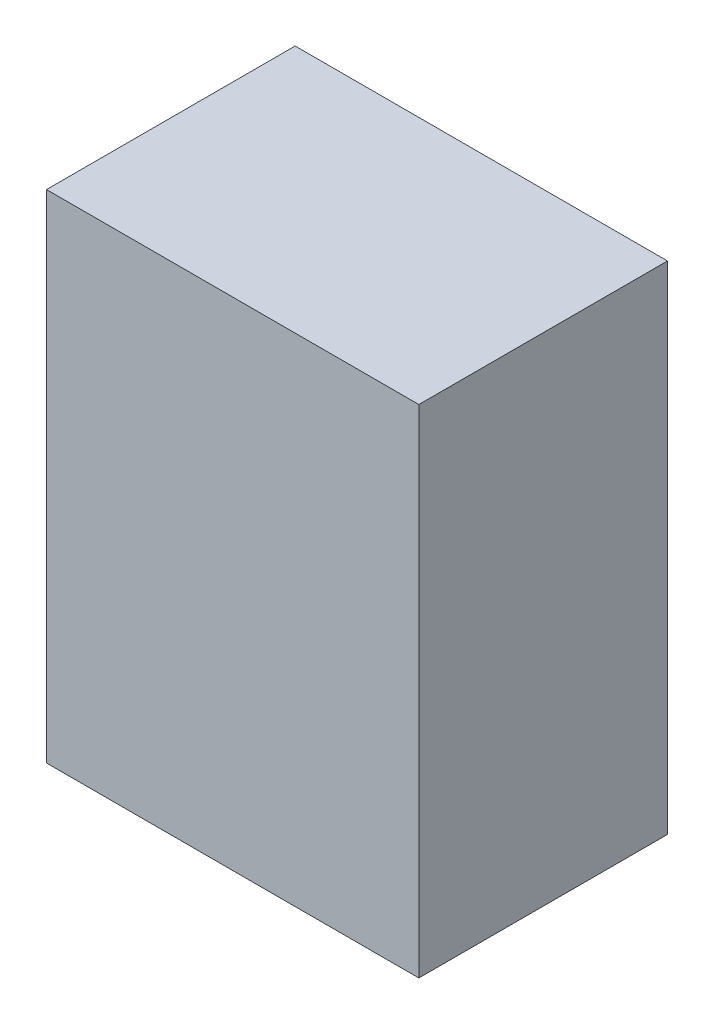
ISO-10303-21;
HEADER;
FILE_DESCRIPTION(('STEP AP214'),'2;1');
FILE_NAME('part.step','',(''),(''),'','','');
FILE_SCHEMA(('AUTOMOTIVE_DESIGN { 1 0 10303 214 1 1 1 1 }'));
ENDSEC;
DATA;
#1=APPLICATION_CONTEXT('core data for automotive mechanical design processes');
#2=APPLICATION_PROTOCOL_DEFINITION('international standard','automotive_design',2000,#1);
#3=PRODUCT_CONTEXT('',#1,'mechanical');
#4=PRODUCT('Part','Part','',(#3));
#5=PRODUCT_RELATED_PRODUCT_CATEGORY('part','',(#4));
#6=PRODUCT_DEFINITION_FORMATION('','',#4);
#7=PRODUCT_DEFINITION_CONTEXT('part definition',#1,'design');
#8=PRODUCT_DEFINITION('design','',#6,#7);
#9=PRODUCT_DEFINITION_SHAPE('','',#8);
#10=(LENGTH_UNIT() NAMED_UNIT(*) SI_UNIT(.MILLI.,.METRE.));
#11=(NAMED_UNIT(*) PLANE_ANGLE_UNIT() SI_UNIT($,.RADIAN.));
#12=(NAMED_UNIT(*) SI_UNIT($,.STERADIAN.) SOLID_ANGLE_UNIT());
#13=UNCERTAINTY_MEASURE_WITH_UNIT(LENGTH_MEASURE(1.E-05),#10,'distance_accuracy_value','');
#14=(GEOMETRIC_REPRESENTATION_CONTEXT(3) GLOBAL_UNCERTAINTY_ASSIGNED_CONTEXT((#13)) GLOBAL_UNIT_ASSIGNED_CONTEXT((#10,
#11,#12)) REPRESENTATION_CONTEXT('',''));
#15=CARTESIAN_POINT('',(0.,0.,0.));
#16=DIRECTION('',(0.,0.,1.));
#17=DIRECTION('',(1.,0.,0.));
#18=AXIS2_PLACEMENT_3D('',#15,#16,#17);
#19=CARTESIAN_POINT('',(-33.0200000000001,167.518150212072,100.076));
#20=DIRECTION('',(1.,0.,0.));
#21=DIRECTION('',(0.,1.,0.));
#22=AXIS2_PLACEMENT_3D('',#19,#20,#21);
#23=PLANE('',#22);
#24=DIRECTION('',(0.,-1.,0.));
#25=VECTOR('',#24,1.);
#26=CARTESIAN_POINT('',(-33.0200000000001,167.518150212072,0.));
#27=LINE('',#26,#25);
#28=CARTESIAN_POINT('',(-33.0200000000001,167.518150212072,0.));
#29=VERTEX_POINT('',#28);
#30=CARTESIAN_POINT('',(-33.0200000000001,-32.3798497879275,0.));
#31=VERTEX_POINT('',#30);
#32=EDGE_CURVE('E72',#29,#31,#27,.T.);
#33=ORIENTED_EDGE('',*,*,#32,.T.);
#34=DIRECTION('',(0.,0.,-1.));
#35=VECTOR('',#34,1.);
#36=CARTESIAN_POINT('',(-33.0200000000001,-32.3798497879275,100.076));
#37=LINE('',#36,#35);
#38=CARTESIAN_POINT('',(-33.0200000000001,-32.3798497879275,100.076));
#39=VERTEX_POINT('',#38);
#40=EDGE_CURVE('E11',#39,#31,#37,.T.);
#41=ORIENTED_EDGE('',*,*,#40,.F.);
#42=DIRECTION('',(0.,-1.,0.));
#43=VECTOR('',#42,1.);
#44=CARTESIAN_POINT('',(-33.0200000000001,167.518150212072,100.076));
#45=LINE('',#44,#43);
#46=CARTESIAN_POINT('',(-33.0200000000001,167.518150212072,100.076));
#47=VERTEX_POINT('',#46);
#48=EDGE_CURVE('E66',#47,#39,#45,.T.);
#49=ORIENTED_EDGE('',*,*,#48,.F.);
#50=DIRECTION('',(0.,0.,-1.));
#51=VECTOR('',#50,1.);
#52=CARTESIAN_POINT('',(-33.0200000000001,167.518150212072,100.076));
#53=LINE('',#52,#51);
#54=EDGE_CURVE('E19',#47,#29,#53,.T.);
#55=ORIENTED_EDGE('',*,*,#54,.T.);
#56=EDGE_LOOP('',(#33,#41,#49,#55));
#57=FACE_BOUND('',#56,.T.);
#58=ADVANCED_FACE('F16',(#57),#23,.F.);
#59=CARTESIAN_POINT('',(-33.0200000000001,-32.3798497879276,100.076));
#60=DIRECTION('',(0.,1.,0.));
#61=DIRECTION('',(-1.,0.,0.));
#62=AXIS2_PLACEMENT_3D('',#59,#60,#61);
#63=PLANE('',#62);
#64=DIRECTION('',(1.,0.,0.));
#65=VECTOR('',#64,1.);
#66=CARTESIAN_POINT('',(-33.0200000000001,-32.3798497879276,0.));
#67=LINE('',#66,#65);
#68=CARTESIAN_POINT('',(116.84,-32.3798497879275,0.));
#69=VERTEX_POINT('',#68);
#70=EDGE_CURVE('E75',#31,#69,#67,.T.);
#71=ORIENTED_EDGE('',*,*,#70,.T.);
#72=DIRECTION('',(0.,0.,-1.));
#73=VECTOR('',#72,1.);
#74=CARTESIAN_POINT('',(116.84,-32.3798497879275,100.076));
#75=LINE('',#74,#73);
#76=CARTESIAN_POINT('',(116.84,-32.3798497879275,100.076));
#77=VERTEX_POINT('',#76);
#78=EDGE_CURVE('E24',#77,#69,#75,.T.);
#79=ORIENTED_EDGE('',*,*,#78,.F.);
#80=DIRECTION('',(1.,0.,0.));
#81=VECTOR('',#80,1.);
#82=CARTESIAN_POINT('',(-33.0200000000001,-32.3798497879276,100.076));
#83=LINE('',#82,#81);
#84=EDGE_CURVE('E36',#39,#77,#83,.T.);
#85=ORIENTED_EDGE('',*,*,#84,.F.);
#86=ORIENTED_EDGE('',*,*,#40,.T.);
#87=EDGE_LOOP('',(#71,#79,#85,#86));
#88=FACE_BOUND('',#87,.T.);
#89=ADVANCED_FACE('F89',(#88),#63,.F.);
#90=CARTESIAN_POINT('',(116.84,-32.3798497879275,100.076));
#91=DIRECTION('',(-1.,0.,0.));
#92=DIRECTION('',(0.,-1.,0.));
#93=AXIS2_PLACEMENT_3D('',#90,#91,#92);
#94=PLANE('',#93);
#95=DIRECTION('',(0.,1.,0.));
#96=VECTOR('',#95,1.);
#97=CARTESIAN_POINT('',(116.84,-32.3798497879275,0.));
#98=LINE('',#97,#96);
#99=CARTESIAN_POINT('',(116.84,167.518150212072,0.));
#100=VERTEX_POINT('',#99);
#101=EDGE_CURVE('E67',#69,#100,#98,.T.);
#102=ORIENTED_EDGE('',*,*,#101,.T.);
#103=DIRECTION('',(0.,0.,-1.));
#104=VECTOR('',#103,1.);
#105=CARTESIAN_POINT('',(116.84,167.518150212072,100.076));
#106=LINE('',#105,#104);
#107=CARTESIAN_POINT('',(116.84,167.518150212072,100.076));
#108=VERTEX_POINT('',#107);
#109=EDGE_CURVE('E62',#108,#100,#106,.T.);
#110=ORIENTED_EDGE('',*,*,#109,.F.);
#111=DIRECTION('',(0.,1.,0.));
#112=VECTOR('',#111,1.);
#113=CARTESIAN_POINT('',(116.84,-32.3798497879275,100.076));
#114=LINE('',#113,#112);
#115=EDGE_CURVE('E31',#77,#108,#114,.T.);
#116=ORIENTED_EDGE('',*,*,#115,.F.);
#117=ORIENTED_EDGE('',*,*,#78,.T.);
#118=EDGE_LOOP('',(#102,#110,#116,#117));
#119=FACE_BOUND('',#118,.T.);
#120=ADVANCED_FACE('F87',(#119),#94,.F.);
#121=CARTESIAN_POINT('',(116.84,167.518150212072,100.076));
#122=DIRECTION('',(0.,-1.,0.));
#123=DIRECTION('',(0.,0.,-1.));
#124=AXIS2_PLACEMENT_3D('',#121,#122,#123);
#125=PLANE('',#124);
#126=DIRECTION('',(-1.,0.,0.));
#127=VECTOR('',#126,1.);
#128=CARTESIAN_POINT('',(116.84,167.518150212072,0.));
#129=LINE('',#128,#127);
#130=EDGE_CURVE('E57',#100,#29,#129,.T.);
#131=ORIENTED_EDGE('',*,*,#130,.T.);
#132=ORIENTED_EDGE('',*,*,#54,.F.);
#133=DIRECTION('',(-1.,0.,0.));
#134=VECTOR('',#133,1.);
#135=CARTESIAN_POINT('',(116.84,167.518150212072,100.076));
#136=LINE('',#135,#134);
#137=EDGE_CURVE('E73',#108,#47,#136,.T.);
#138=ORIENTED_EDGE('',*,*,#137,.F.);
#139=ORIENTED_EDGE('',*,*,#109,.T.);
#140=EDGE_LOOP('',(#131,#132,#138,#139));
#141=FACE_BOUND('',#140,.T.);
#142=ADVANCED_FACE('F59',(#141),#125,.F.);
#143=CARTESIAN_POINT('',(-33.0200000000001,167.518150212072,100.076));
#144=DIRECTION('',(0.,0.,-1.));
#145=DIRECTION('',(-1.,0.,0.));
#146=AXIS2_PLACEMENT_3D('',#143,#144,#145);
#147=PLANE('',#146);
#148=ORIENTED_EDGE('',*,*,#48,.T.);
#149=ORIENTED_EDGE('',*,*,#84,.T.);
#150=ORIENTED_EDGE('',*,*,#115,.T.);
#151=ORIENTED_EDGE('',*,*,#137,.T.);
#152=EDGE_LOOP('',(#148,#149,#150,#151));
#153=FACE_BOUND('',#152,.T.);
#154=ADVANCED_FACE('F90',(#153),#147,.F.);
#155=CARTESIAN_POINT('',(-33.0200000000001,167.518150212072,0.));
#156=DIRECTION('',(0.,0.,-1.));
#157=DIRECTION('',(-1.,0.,0.));
#158=AXIS2_PLACEMENT_3D('',#155,#156,#157);
#159=PLANE('',#158);
#160=ORIENTED_EDGE('',*,*,#32,.F.);
#161=ORIENTED_EDGE('',*,*,#130,.F.);
#162=ORIENTED_EDGE('',*,*,#101,.F.);
#163=ORIENTED_EDGE('',*,*,#70,.F.);
#164=EDGE_LOOP('',(#160,#161,#162,#163));
#165=FACE_BOUND('',#164,.T.);
#166=ADVANCED_FACE('F74',(#165),#159,.T.);
#167=CLOSED_SHELL('',(#58,#89,#120,#142,#154,#166));
#168=MANIFOLD_SOLID_BREP('B1',#167);
#169=ADVANCED_BREP_SHAPE_REPRESENTATION('',(#18,#168),#14);
#170=SHAPE_DEFINITION_REPRESENTATION(#9,#169);
ENDSEC;
END-ISO-10303-21;
